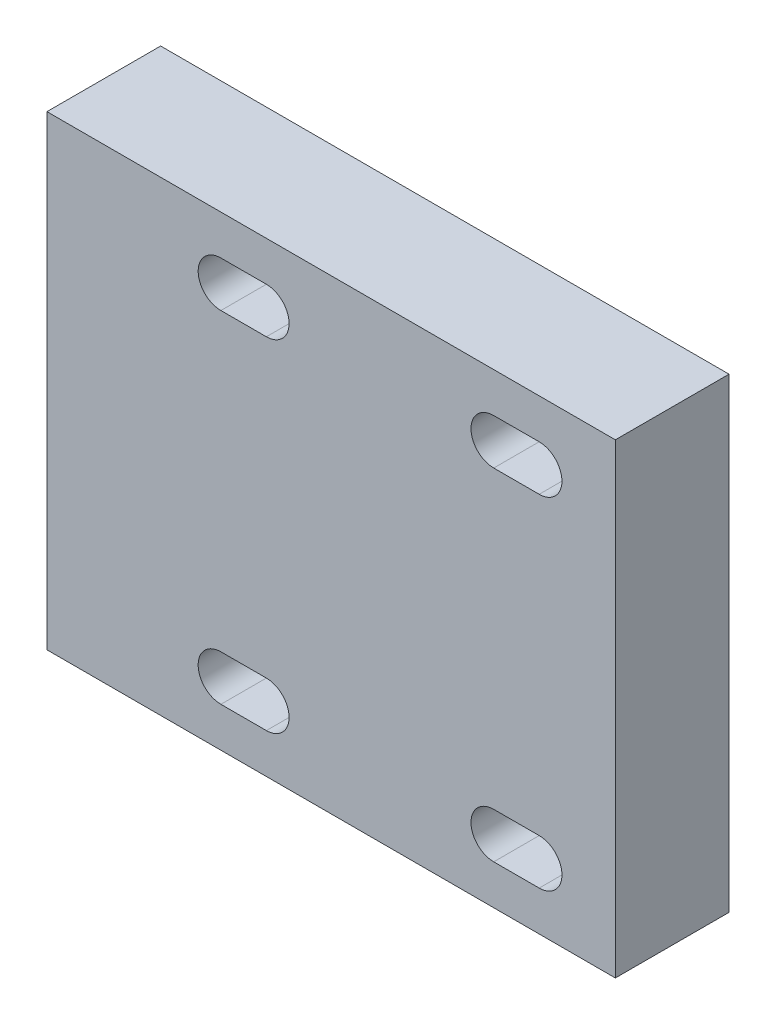
ISO-10303-21;
HEADER;
FILE_DESCRIPTION(('STEP AP214'),'2;1');
FILE_NAME('part.step','',(''),(''),'','','');
FILE_SCHEMA(('AUTOMOTIVE_DESIGN { 1 0 10303 214 1 1 1 1 }'));
ENDSEC;
DATA;
#1=APPLICATION_CONTEXT('core data for automotive mechanical design processes');
#2=APPLICATION_PROTOCOL_DEFINITION('international standard','automotive_design',2000,#1);
#3=PRODUCT_CONTEXT('',#1,'mechanical');
#4=PRODUCT('Part','Part','',(#3));
#5=PRODUCT_RELATED_PRODUCT_CATEGORY('part','',(#4));
#6=PRODUCT_DEFINITION_FORMATION('','',#4);
#7=PRODUCT_DEFINITION_CONTEXT('part definition',#1,'design');
#8=PRODUCT_DEFINITION('design','',#6,#7);
#9=PRODUCT_DEFINITION_SHAPE('','',#8);
#10=(LENGTH_UNIT() NAMED_UNIT(*) SI_UNIT(.MILLI.,.METRE.));
#11=(NAMED_UNIT(*) PLANE_ANGLE_UNIT() SI_UNIT($,.RADIAN.));
#12=(NAMED_UNIT(*) SI_UNIT($,.STERADIAN.) SOLID_ANGLE_UNIT());
#13=UNCERTAINTY_MEASURE_WITH_UNIT(LENGTH_MEASURE(1.E-05),#10,'distance_accuracy_value','');
#14=(GEOMETRIC_REPRESENTATION_CONTEXT(3) GLOBAL_UNCERTAINTY_ASSIGNED_CONTEXT((#13)) GLOBAL_UNIT_ASSIGNED_CONTEXT((#10,
#11,#12)) REPRESENTATION_CONTEXT('',''));
#15=CARTESIAN_POINT('',(0.,0.,0.));
#16=DIRECTION('',(0.,0.,1.));
#17=DIRECTION('',(1.,0.,0.));
#18=AXIS2_PLACEMENT_3D('',#15,#16,#17);
#19=CARTESIAN_POINT('',(-25.,-20.5,10.));
#20=DIRECTION('',(1.,0.,0.));
#21=DIRECTION('',(0.,0.,-1.));
#22=AXIS2_PLACEMENT_3D('',#19,#20,#21);
#23=PLANE('',#22);
#24=DIRECTION('',(0.,-1.,0.));
#25=VECTOR('',#24,1.);
#26=CARTESIAN_POINT('',(-25.,-20.5,0.));
#27=LINE('',#26,#25);
#28=CARTESIAN_POINT('',(-25.,20.5,0.));
#29=VERTEX_POINT('',#28);
#30=CARTESIAN_POINT('',(-25.,-20.5,0.));
#31=VERTEX_POINT('',#30);
#32=EDGE_CURVE('E297',#29,#31,#27,.T.);
#33=ORIENTED_EDGE('',*,*,#32,.T.);
#34=DIRECTION('',(0.,0.,-1.));
#35=VECTOR('',#34,1.);
#36=CARTESIAN_POINT('',(-25.,-20.5,10.));
#37=LINE('',#36,#35);
#38=CARTESIAN_POINT('',(-25.,-20.5,10.));
#39=VERTEX_POINT('',#38);
#40=EDGE_CURVE('E11',#39,#31,#37,.T.);
#41=ORIENTED_EDGE('',*,*,#40,.F.);
#42=DIRECTION('',(0.,-1.,0.));
#43=VECTOR('',#42,1.);
#44=CARTESIAN_POINT('',(-25.,-20.5,10.));
#45=LINE('',#44,#43);
#46=CARTESIAN_POINT('',(-25.,20.5,10.));
#47=VERTEX_POINT('',#46);
#48=EDGE_CURVE('E304',#47,#39,#45,.T.);
#49=ORIENTED_EDGE('',*,*,#48,.F.);
#50=DIRECTION('',(0.,0.,-1.));
#51=VECTOR('',#50,1.);
#52=CARTESIAN_POINT('',(-25.,20.5,10.));
#53=LINE('',#52,#51);
#54=EDGE_CURVE('E314',#47,#29,#53,.T.);
#55=ORIENTED_EDGE('',*,*,#54,.T.);
#56=EDGE_LOOP('',(#33,#41,#49,#55));
#57=FACE_BOUND('',#56,.T.);
#58=ADVANCED_FACE('F32',(#57),#23,.F.);
#59=CARTESIAN_POINT('',(25.,-20.5,10.));
#60=DIRECTION('',(0.,1.,0.));
#61=DIRECTION('',(-1.,0.,0.));
#62=AXIS2_PLACEMENT_3D('',#59,#60,#61);
#63=PLANE('',#62);
#64=DIRECTION('',(1.,0.,0.));
#65=VECTOR('',#64,1.);
#66=CARTESIAN_POINT('',(25.,-20.5,0.));
#67=LINE('',#66,#65);
#68=CARTESIAN_POINT('',(25.,-20.5,0.));
#69=VERTEX_POINT('',#68);
#70=EDGE_CURVE('E317',#31,#69,#67,.T.);
#71=ORIENTED_EDGE('',*,*,#70,.T.);
#72=DIRECTION('',(0.,0.,-1.));
#73=VECTOR('',#72,1.);
#74=CARTESIAN_POINT('',(25.,-20.5,10.));
#75=LINE('',#74,#73);
#76=CARTESIAN_POINT('',(25.,-20.5,10.));
#77=VERTEX_POINT('',#76);
#78=EDGE_CURVE('E39',#77,#69,#75,.T.);
#79=ORIENTED_EDGE('',*,*,#78,.F.);
#80=DIRECTION('',(1.,0.,0.));
#81=VECTOR('',#80,1.);
#82=CARTESIAN_POINT('',(25.,-20.5,10.));
#83=LINE('',#82,#81);
#84=EDGE_CURVE('E307',#39,#77,#83,.T.);
#85=ORIENTED_EDGE('',*,*,#84,.F.);
#86=ORIENTED_EDGE('',*,*,#40,.T.);
#87=EDGE_LOOP('',(#71,#79,#85,#86));
#88=FACE_BOUND('',#87,.T.);
#89=ADVANCED_FACE('F346',(#88),#63,.F.);
#90=CARTESIAN_POINT('',(25.,20.5,10.));
#91=DIRECTION('',(-1.,0.,0.));
#92=DIRECTION('',(0.,-1.,0.));
#93=AXIS2_PLACEMENT_3D('',#90,#91,#92);
#94=PLANE('',#93);
#95=DIRECTION('',(0.,1.,0.));
#96=VECTOR('',#95,1.);
#97=CARTESIAN_POINT('',(25.,20.5,0.));
#98=LINE('',#97,#96);
#99=CARTESIAN_POINT('',(25.,20.5,0.));
#100=VERTEX_POINT('',#99);
#101=EDGE_CURVE('E319',#69,#100,#98,.T.);
#102=ORIENTED_EDGE('',*,*,#101,.T.);
#103=DIRECTION('',(0.,0.,-1.));
#104=VECTOR('',#103,1.);
#105=CARTESIAN_POINT('',(25.,20.5,10.));
#106=LINE('',#105,#104);
#107=CARTESIAN_POINT('',(25.,20.5,10.));
#108=VERTEX_POINT('',#107);
#109=EDGE_CURVE('E324',#108,#100,#106,.T.);
#110=ORIENTED_EDGE('',*,*,#109,.F.);
#111=DIRECTION('',(0.,1.,0.));
#112=VECTOR('',#111,1.);
#113=CARTESIAN_POINT('',(25.,20.5,10.));
#114=LINE('',#113,#112);
#115=EDGE_CURVE('E310',#77,#108,#114,.T.);
#116=ORIENTED_EDGE('',*,*,#115,.F.);
#117=ORIENTED_EDGE('',*,*,#78,.T.);
#118=EDGE_LOOP('',(#102,#110,#116,#117));
#119=FACE_BOUND('',#118,.T.);
#120=ADVANCED_FACE('F331',(#119),#94,.F.);
#121=CARTESIAN_POINT('',(-25.,20.5,10.));
#122=DIRECTION('',(0.,-1.,0.));
#123=DIRECTION('',(0.,0.,-1.));
#124=AXIS2_PLACEMENT_3D('',#121,#122,#123);
#125=PLANE('',#124);
#126=DIRECTION('',(-1.,0.,0.));
#127=VECTOR('',#126,1.);
#128=CARTESIAN_POINT('',(-25.,20.5,0.));
#129=LINE('',#128,#127);
#130=EDGE_CURVE('E308',#100,#29,#129,.T.);
#131=ORIENTED_EDGE('',*,*,#130,.T.);
#132=ORIENTED_EDGE('',*,*,#54,.F.);
#133=DIRECTION('',(-1.,0.,0.));
#134=VECTOR('',#133,1.);
#135=CARTESIAN_POINT('',(-25.,20.5,10.));
#136=LINE('',#135,#134);
#137=EDGE_CURVE('E312',#108,#47,#136,.T.);
#138=ORIENTED_EDGE('',*,*,#137,.F.);
#139=ORIENTED_EDGE('',*,*,#109,.T.);
#140=EDGE_LOOP('',(#131,#132,#138,#139));
#141=FACE_BOUND('',#140,.T.);
#142=ADVANCED_FACE('F340',(#141),#125,.F.);
#143=CARTESIAN_POINT('',(0.,0.,10.));
#144=DIRECTION('',(0.,0.,-1.));
#145=DIRECTION('',(-1.,0.,0.));
#146=AXIS2_PLACEMENT_3D('',#143,#144,#145);
#147=PLANE('',#146);
#148=DIRECTION('',(-1.,0.,0.));
#149=VECTOR('',#148,1.);
#150=CARTESIAN_POINT('',(18.2999999999988,13.0000000000002,10.));
#151=LINE('',#150,#149);
#152=CARTESIAN_POINT('',(18.2999999999988,13.0000000000002,10.));
#153=VERTEX_POINT('',#152);
#154=CARTESIAN_POINT('',(14.2999999999987,13.0000000000002,10.));
#155=VERTEX_POINT('',#154);
#156=EDGE_CURVE('E220',#153,#155,#151,.T.);
#157=ORIENTED_EDGE('',*,*,#156,.T.);
#158=CARTESIAN_POINT('',(14.2999999999987,15.0000000000002,10.));
#159=DIRECTION('',(0.,0.,-1.));
#160=DIRECTION('',(-1.,0.,0.));
#161=AXIS2_PLACEMENT_3D('',#158,#159,#160);
#162=CIRCLE('',#161,2.00000000000001);
#163=CARTESIAN_POINT('',(14.2999999999987,17.0000000000002,10.));
#164=VERTEX_POINT('',#163);
#165=EDGE_CURVE('E212',#155,#164,#162,.T.);
#166=ORIENTED_EDGE('',*,*,#165,.T.);
#167=DIRECTION('',(1.,0.,0.));
#168=VECTOR('',#167,1.);
#169=CARTESIAN_POINT('',(14.2999999999987,17.0000000000002,10.));
#170=LINE('',#169,#168);
#171=CARTESIAN_POINT('',(18.2999999999988,17.0000000000002,10.));
#172=VERTEX_POINT('',#171);
#173=EDGE_CURVE('E215',#164,#172,#170,.T.);
#174=ORIENTED_EDGE('',*,*,#173,.T.);
#175=CARTESIAN_POINT('',(18.2999999999988,15.0000000000002,10.));
#176=DIRECTION('',(0.,0.,-1.));
#177=DIRECTION('',(-1.,0.,0.));
#178=AXIS2_PLACEMENT_3D('',#175,#176,#177);
#179=CIRCLE('',#178,2.00000000000001);
#180=EDGE_CURVE('E46',#172,#153,#179,.T.);
#181=ORIENTED_EDGE('',*,*,#180,.T.);
#182=EDGE_LOOP('',(#157,#166,#174,#181));
#183=FACE_BOUND('',#182,.T.);
#184=DIRECTION('',(1.,0.,0.));
#185=VECTOR('',#184,1.);
#186=CARTESIAN_POINT('',(-5.70000000000125,-13.0000000000002,10.));
#187=LINE('',#186,#185);
#188=CARTESIAN_POINT('',(-9.70000000000126,-13.0000000000002,10.));
#189=VERTEX_POINT('',#188);
#190=CARTESIAN_POINT('',(-5.70000000000125,-13.0000000000002,10.));
#191=VERTEX_POINT('',#190);
#192=EDGE_CURVE('E252',#189,#191,#187,.T.);
#193=ORIENTED_EDGE('',*,*,#192,.T.);
#194=CARTESIAN_POINT('',(-5.70000000000125,-15.0000000000002,10.));
#195=DIRECTION('',(0.,0.,-1.));
#196=DIRECTION('',(1.,0.,0.));
#197=AXIS2_PLACEMENT_3D('',#194,#195,#196);
#198=CIRCLE('',#197,2.);
#199=CARTESIAN_POINT('',(-5.70000000000125,-17.0000000000002,10.));
#200=VERTEX_POINT('',#199);
#201=EDGE_CURVE('E244',#191,#200,#198,.T.);
#202=ORIENTED_EDGE('',*,*,#201,.T.);
#203=DIRECTION('',(-1.,0.,0.));
#204=VECTOR('',#203,1.);
#205=CARTESIAN_POINT('',(-9.70000000000126,-17.0000000000002,10.));
#206=LINE('',#205,#204);
#207=CARTESIAN_POINT('',(-9.70000000000126,-17.0000000000002,10.));
#208=VERTEX_POINT('',#207);
#209=EDGE_CURVE('E247',#200,#208,#206,.T.);
#210=ORIENTED_EDGE('',*,*,#209,.T.);
#211=CARTESIAN_POINT('',(-9.70000000000126,-15.0000000000002,10.));
#212=DIRECTION('',(0.,0.,-1.));
#213=DIRECTION('',(1.,0.,0.));
#214=AXIS2_PLACEMENT_3D('',#211,#212,#213);
#215=CIRCLE('',#214,2.00000000000001);
#216=EDGE_CURVE('E54',#208,#189,#215,.T.);
#217=ORIENTED_EDGE('',*,*,#216,.T.);
#218=EDGE_LOOP('',(#193,#202,#210,#217));
#219=FACE_BOUND('',#218,.T.);
#220=DIRECTION('',(1.,0.,0.));
#221=VECTOR('',#220,1.);
#222=CARTESIAN_POINT('',(18.2999999999988,-13.0000000000002,10.));
#223=LINE('',#222,#221);
#224=CARTESIAN_POINT('',(14.2999999999987,-13.0000000000002,10.));
#225=VERTEX_POINT('',#224);
#226=CARTESIAN_POINT('',(18.2999999999988,-13.0000000000002,10.));
#227=VERTEX_POINT('',#226);
#228=EDGE_CURVE('E180',#225,#227,#223,.T.);
#229=ORIENTED_EDGE('',*,*,#228,.T.);
#230=CARTESIAN_POINT('',(18.2999999999988,-15.0000000000002,10.));
#231=DIRECTION('',(0.,0.,-1.));
#232=DIRECTION('',(1.,0.,0.));
#233=AXIS2_PLACEMENT_3D('',#230,#231,#232);
#234=CIRCLE('',#233,2.00000000000001);
#235=CARTESIAN_POINT('',(18.2999999999988,-17.0000000000002,10.));
#236=VERTEX_POINT('',#235);
#237=EDGE_CURVE('E172',#227,#236,#234,.T.);
#238=ORIENTED_EDGE('',*,*,#237,.T.);
#239=DIRECTION('',(-1.,0.,0.));
#240=VECTOR('',#239,1.);
#241=CARTESIAN_POINT('',(14.2999999999987,-17.0000000000002,10.));
#242=LINE('',#241,#240);
#243=CARTESIAN_POINT('',(14.2999999999987,-17.0000000000002,10.));
#244=VERTEX_POINT('',#243);
#245=EDGE_CURVE('E184',#236,#244,#242,.T.);
#246=ORIENTED_EDGE('',*,*,#245,.T.);
#247=CARTESIAN_POINT('',(14.2999999999987,-15.0000000000002,10.));
#248=DIRECTION('',(0.,0.,-1.));
#249=DIRECTION('',(1.,0.,0.));
#250=AXIS2_PLACEMENT_3D('',#247,#248,#249);
#251=CIRCLE('',#250,2.00000000000001);
#252=EDGE_CURVE('E188',#244,#225,#251,.T.);
#253=ORIENTED_EDGE('',*,*,#252,.T.);
#254=EDGE_LOOP('',(#229,#238,#246,#253));
#255=FACE_BOUND('',#254,.T.);
#256=DIRECTION('',(1.,0.,0.));
#257=VECTOR('',#256,1.);
#258=CARTESIAN_POINT('',(-9.70000000000126,17.0000000000002,10.));
#259=LINE('',#258,#257);
#260=CARTESIAN_POINT('',(-9.70000000000126,17.0000000000002,10.));
#261=VERTEX_POINT('',#260);
#262=CARTESIAN_POINT('',(-5.70000000000125,17.0000000000002,10.));
#263=VERTEX_POINT('',#262);
#264=EDGE_CURVE('E282',#261,#263,#259,.T.);
#265=ORIENTED_EDGE('',*,*,#264,.T.);
#266=CARTESIAN_POINT('',(-5.70000000000125,15.0000000000002,10.));
#267=DIRECTION('',(0.,0.,-1.));
#268=DIRECTION('',(-1.,0.,0.));
#269=AXIS2_PLACEMENT_3D('',#266,#267,#268);
#270=CIRCLE('',#269,2.);
#271=CARTESIAN_POINT('',(-5.70000000000125,13.0000000000002,10.));
#272=VERTEX_POINT('',#271);
#273=EDGE_CURVE('E272',#263,#272,#270,.T.);
#274=ORIENTED_EDGE('',*,*,#273,.T.);
#275=DIRECTION('',(-1.,0.,0.));
#276=VECTOR('',#275,1.);
#277=CARTESIAN_POINT('',(-5.70000000000125,13.0000000000002,10.));
#278=LINE('',#277,#276);
#279=CARTESIAN_POINT('',(-9.70000000000126,13.0000000000002,10.));
#280=VERTEX_POINT('',#279);
#281=EDGE_CURVE('E275',#272,#280,#278,.T.);
#282=ORIENTED_EDGE('',*,*,#281,.T.);
#283=CARTESIAN_POINT('',(-9.70000000000126,15.0000000000002,10.));
#284=DIRECTION('',(0.,0.,-1.));
#285=DIRECTION('',(-1.,0.,0.));
#286=AXIS2_PLACEMENT_3D('',#283,#284,#285);
#287=CIRCLE('',#286,2.00000000000001);
#288=EDGE_CURVE('E279',#280,#261,#287,.T.);
#289=ORIENTED_EDGE('',*,*,#288,.T.);
#290=EDGE_LOOP('',(#265,#274,#282,#289));
#291=FACE_BOUND('',#290,.T.);
#292=ORIENTED_EDGE('',*,*,#48,.T.);
#293=ORIENTED_EDGE('',*,*,#84,.T.);
#294=ORIENTED_EDGE('',*,*,#115,.T.);
#295=ORIENTED_EDGE('',*,*,#137,.T.);
#296=EDGE_LOOP('',(#292,#293,#294,#295));
#297=FACE_BOUND('',#296,.T.);
#298=ADVANCED_FACE('F190',(#183,#219,#255,#291,#297),#147,.F.);
#299=CARTESIAN_POINT('',(0.,0.,0.));
#300=DIRECTION('',(0.,0.,-1.));
#301=DIRECTION('',(-1.,0.,0.));
#302=AXIS2_PLACEMENT_3D('',#299,#300,#301);
#303=PLANE('',#302);
#304=CARTESIAN_POINT('',(14.2999999999987,15.0000000000002,0.));
#305=DIRECTION('',(0.,0.,-1.));
#306=DIRECTION('',(-1.,0.,0.));
#307=AXIS2_PLACEMENT_3D('',#304,#305,#306);
#308=CIRCLE('',#307,2.00000000000001);
#309=CARTESIAN_POINT('',(14.2999999999987,13.0000000000002,0.));
#310=VERTEX_POINT('',#309);
#311=CARTESIAN_POINT('',(14.2999999999987,17.0000000000002,0.));
#312=VERTEX_POINT('',#311);
#313=EDGE_CURVE('E224',#310,#312,#308,.T.);
#314=ORIENTED_EDGE('',*,*,#313,.F.);
#315=DIRECTION('',(-1.,0.,0.));
#316=VECTOR('',#315,1.);
#317=CARTESIAN_POINT('',(18.2999999999988,13.0000000000002,0.));
#318=LINE('',#317,#316);
#319=CARTESIAN_POINT('',(18.2999999999988,13.0000000000002,0.));
#320=VERTEX_POINT('',#319);
#321=EDGE_CURVE('E216',#320,#310,#318,.T.);
#322=ORIENTED_EDGE('',*,*,#321,.F.);
#323=CARTESIAN_POINT('',(18.2999999999988,15.0000000000002,0.));
#324=DIRECTION('',(0.,0.,-1.));
#325=DIRECTION('',(-1.,0.,0.));
#326=AXIS2_PLACEMENT_3D('',#323,#324,#325);
#327=CIRCLE('',#326,2.00000000000001);
#328=CARTESIAN_POINT('',(18.2999999999988,17.0000000000002,0.));
#329=VERTEX_POINT('',#328);
#330=EDGE_CURVE('E230',#329,#320,#327,.T.);
#331=ORIENTED_EDGE('',*,*,#330,.F.);
#332=DIRECTION('',(1.,0.,0.));
#333=VECTOR('',#332,1.);
#334=CARTESIAN_POINT('',(14.2999999999987,17.0000000000002,0.));
#335=LINE('',#334,#333);
#336=EDGE_CURVE('E226',#312,#329,#335,.T.);
#337=ORIENTED_EDGE('',*,*,#336,.F.);
#338=EDGE_LOOP('',(#314,#322,#331,#337));
#339=FACE_BOUND('',#338,.T.);
#340=CARTESIAN_POINT('',(-5.70000000000125,-15.0000000000002,0.));
#341=DIRECTION('',(0.,0.,-1.));
#342=DIRECTION('',(1.,0.,0.));
#343=AXIS2_PLACEMENT_3D('',#340,#341,#342);
#344=CIRCLE('',#343,2.);
#345=CARTESIAN_POINT('',(-5.70000000000125,-13.0000000000002,0.));
#346=VERTEX_POINT('',#345);
#347=CARTESIAN_POINT('',(-5.70000000000125,-17.0000000000002,0.));
#348=VERTEX_POINT('',#347);
#349=EDGE_CURVE('E208',#346,#348,#344,.T.);
#350=ORIENTED_EDGE('',*,*,#349,.F.);
#351=DIRECTION('',(1.,0.,0.));
#352=VECTOR('',#351,1.);
#353=CARTESIAN_POINT('',(-5.70000000000125,-13.0000000000002,0.));
#354=LINE('',#353,#352);
#355=CARTESIAN_POINT('',(-9.70000000000126,-13.0000000000002,0.));
#356=VERTEX_POINT('',#355);
#357=EDGE_CURVE('E248',#356,#346,#354,.T.);
#358=ORIENTED_EDGE('',*,*,#357,.F.);
#359=CARTESIAN_POINT('',(-9.70000000000126,-15.0000000000002,0.));
#360=DIRECTION('',(0.,0.,-1.));
#361=DIRECTION('',(1.,0.,0.));
#362=AXIS2_PLACEMENT_3D('',#359,#360,#361);
#363=CIRCLE('',#362,2.00000000000001);
#364=CARTESIAN_POINT('',(-9.70000000000126,-17.0000000000002,0.));
#365=VERTEX_POINT('',#364);
#366=EDGE_CURVE('E260',#365,#356,#363,.T.);
#367=ORIENTED_EDGE('',*,*,#366,.F.);
#368=DIRECTION('',(-1.,0.,0.));
#369=VECTOR('',#368,1.);
#370=CARTESIAN_POINT('',(-9.70000000000126,-17.0000000000002,0.));
#371=LINE('',#370,#369);
#372=EDGE_CURVE('E257',#348,#365,#371,.T.);
#373=ORIENTED_EDGE('',*,*,#372,.F.);
#374=EDGE_LOOP('',(#350,#358,#367,#373));
#375=FACE_BOUND('',#374,.T.);
#376=CARTESIAN_POINT('',(18.2999999999988,-15.0000000000002,0.));
#377=DIRECTION('',(0.,0.,-1.));
#378=DIRECTION('',(1.,0.,0.));
#379=AXIS2_PLACEMENT_3D('',#376,#377,#378);
#380=CIRCLE('',#379,2.00000000000001);
#381=CARTESIAN_POINT('',(18.2999999999988,-13.0000000000002,0.));
#382=VERTEX_POINT('',#381);
#383=CARTESIAN_POINT('',(18.2999999999988,-17.0000000000002,0.));
#384=VERTEX_POINT('',#383);
#385=EDGE_CURVE('E175',#382,#384,#380,.T.);
#386=ORIENTED_EDGE('',*,*,#385,.F.);
#387=DIRECTION('',(1.,0.,0.));
#388=VECTOR('',#387,1.);
#389=CARTESIAN_POINT('',(18.2999999999988,-13.0000000000002,0.));
#390=LINE('',#389,#388);
#391=CARTESIAN_POINT('',(14.2999999999987,-13.0000000000002,0.));
#392=VERTEX_POINT('',#391);
#393=EDGE_CURVE('E193',#392,#382,#390,.T.);
#394=ORIENTED_EDGE('',*,*,#393,.F.);
#395=CARTESIAN_POINT('',(14.2999999999987,-15.0000000000002,0.));
#396=DIRECTION('',(0.,0.,-1.));
#397=DIRECTION('',(1.,0.,0.));
#398=AXIS2_PLACEMENT_3D('',#395,#396,#397);
#399=CIRCLE('',#398,2.00000000000001);
#400=CARTESIAN_POINT('',(14.2999999999987,-17.0000000000002,0.));
#401=VERTEX_POINT('',#400);
#402=EDGE_CURVE('E196',#401,#392,#399,.T.);
#403=ORIENTED_EDGE('',*,*,#402,.F.);
#404=DIRECTION('',(-1.,0.,0.));
#405=VECTOR('',#404,1.);
#406=CARTESIAN_POINT('',(14.2999999999987,-17.0000000000002,0.));
#407=LINE('',#406,#405);
#408=EDGE_CURVE('E202',#384,#401,#407,.T.);
#409=ORIENTED_EDGE('',*,*,#408,.F.);
#410=EDGE_LOOP('',(#386,#394,#403,#409));
#411=FACE_BOUND('',#410,.T.);
#412=CARTESIAN_POINT('',(-5.70000000000125,15.0000000000002,0.));
#413=DIRECTION('',(0.,0.,-1.));
#414=DIRECTION('',(-1.,0.,0.));
#415=AXIS2_PLACEMENT_3D('',#412,#413,#414);
#416=CIRCLE('',#415,2.);
#417=CARTESIAN_POINT('',(-5.70000000000125,17.0000000000002,0.));
#418=VERTEX_POINT('',#417);
#419=CARTESIAN_POINT('',(-5.70000000000125,13.0000000000002,0.));
#420=VERTEX_POINT('',#419);
#421=EDGE_CURVE('E237',#418,#420,#416,.T.);
#422=ORIENTED_EDGE('',*,*,#421,.F.);
#423=DIRECTION('',(1.,0.,0.));
#424=VECTOR('',#423,1.);
#425=CARTESIAN_POINT('',(-9.70000000000126,17.0000000000002,0.));
#426=LINE('',#425,#424);
#427=CARTESIAN_POINT('',(-9.70000000000126,17.0000000000002,0.));
#428=VERTEX_POINT('',#427);
#429=EDGE_CURVE('E276',#428,#418,#426,.T.);
#430=ORIENTED_EDGE('',*,*,#429,.F.);
#431=CARTESIAN_POINT('',(-9.70000000000126,15.0000000000002,0.));
#432=DIRECTION('',(0.,0.,-1.));
#433=DIRECTION('',(-1.,0.,0.));
#434=AXIS2_PLACEMENT_3D('',#431,#432,#433);
#435=CIRCLE('',#434,2.00000000000001);
#436=CARTESIAN_POINT('',(-9.70000000000126,13.0000000000002,0.));
#437=VERTEX_POINT('',#436);
#438=EDGE_CURVE('E290',#437,#428,#435,.T.);
#439=ORIENTED_EDGE('',*,*,#438,.F.);
#440=DIRECTION('',(-1.,0.,0.));
#441=VECTOR('',#440,1.);
#442=CARTESIAN_POINT('',(-5.70000000000125,13.0000000000002,0.));
#443=LINE('',#442,#441);
#444=EDGE_CURVE('E287',#420,#437,#443,.T.);
#445=ORIENTED_EDGE('',*,*,#444,.F.);
#446=EDGE_LOOP('',(#422,#430,#439,#445));
#447=FACE_BOUND('',#446,.T.);
#448=ORIENTED_EDGE('',*,*,#32,.F.);
#449=ORIENTED_EDGE('',*,*,#130,.F.);
#450=ORIENTED_EDGE('',*,*,#101,.F.);
#451=ORIENTED_EDGE('',*,*,#70,.F.);
#452=EDGE_LOOP('',(#448,#449,#450,#451));
#453=FACE_BOUND('',#452,.T.);
#454=ADVANCED_FACE('F337',(#339,#375,#411,#447,#453),#303,.T.);
#455=CARTESIAN_POINT('',(-5.70000000000125,15.0000000000002,10.));
#456=DIRECTION('',(0.,0.,-1.));
#457=DIRECTION('',(-1.,0.,0.));
#458=AXIS2_PLACEMENT_3D('',#455,#456,#457);
#459=CYLINDRICAL_SURFACE('',#458,2.);
#460=ORIENTED_EDGE('',*,*,#421,.T.);
#461=DIRECTION('',(0.,0.,-1.));
#462=VECTOR('',#461,1.);
#463=CARTESIAN_POINT('',(-5.70000000000125,13.0000000000002,10.));
#464=LINE('',#463,#462);
#465=EDGE_CURVE('E285',#272,#420,#464,.T.);
#466=ORIENTED_EDGE('',*,*,#465,.F.);
#467=ORIENTED_EDGE('',*,*,#273,.F.);
#468=DIRECTION('',(0.,0.,-1.));
#469=VECTOR('',#468,1.);
#470=CARTESIAN_POINT('',(-5.70000000000125,17.0000000000002,10.));
#471=LINE('',#470,#469);
#472=EDGE_CURVE('E295',#263,#418,#471,.T.);
#473=ORIENTED_EDGE('',*,*,#472,.T.);
#474=EDGE_LOOP('',(#460,#466,#467,#473));
#475=FACE_BOUND('',#474,.T.);
#476=ADVANCED_FACE('F358',(#475),#459,.F.);
#477=CARTESIAN_POINT('',(-9.70000000000126,17.0000000000002,10.));
#478=DIRECTION('',(0.,1.,0.));
#479=DIRECTION('',(0.,0.,1.));
#480=AXIS2_PLACEMENT_3D('',#477,#478,#479);
#481=PLANE('',#480);
#482=ORIENTED_EDGE('',*,*,#429,.T.);
#483=ORIENTED_EDGE('',*,*,#472,.F.);
#484=ORIENTED_EDGE('',*,*,#264,.F.);
#485=DIRECTION('',(0.,0.,-1.));
#486=VECTOR('',#485,1.);
#487=CARTESIAN_POINT('',(-9.70000000000126,17.0000000000002,10.));
#488=LINE('',#487,#486);
#489=EDGE_CURVE('E298',#261,#428,#488,.T.);
#490=ORIENTED_EDGE('',*,*,#489,.T.);
#491=EDGE_LOOP('',(#482,#483,#484,#490));
#492=FACE_BOUND('',#491,.T.);
#493=ADVANCED_FACE('F365',(#492),#481,.F.);
#494=CARTESIAN_POINT('',(-9.70000000000126,15.0000000000002,10.));
#495=DIRECTION('',(0.,0.,-1.));
#496=DIRECTION('',(-1.,0.,0.));
#497=AXIS2_PLACEMENT_3D('',#494,#495,#496);
#498=CYLINDRICAL_SURFACE('',#497,2.00000000000001);
#499=ORIENTED_EDGE('',*,*,#438,.T.);
#500=ORIENTED_EDGE('',*,*,#489,.F.);
#501=ORIENTED_EDGE('',*,*,#288,.F.);
#502=DIRECTION('',(0.,0.,-1.));
#503=VECTOR('',#502,1.);
#504=CARTESIAN_POINT('',(-9.70000000000126,13.0000000000002,10.));
#505=LINE('',#504,#503);
#506=EDGE_CURVE('E300',#280,#437,#505,.T.);
#507=ORIENTED_EDGE('',*,*,#506,.T.);
#508=EDGE_LOOP('',(#499,#500,#501,#507));
#509=FACE_BOUND('',#508,.T.);
#510=ADVANCED_FACE('F370',(#509),#498,.F.);
#511=CARTESIAN_POINT('',(-5.70000000000125,13.0000000000002,10.));
#512=DIRECTION('',(0.,-1.,0.));
#513=DIRECTION('',(1.,0.,0.));
#514=AXIS2_PLACEMENT_3D('',#511,#512,#513);
#515=PLANE('',#514);
#516=ORIENTED_EDGE('',*,*,#444,.T.);
#517=ORIENTED_EDGE('',*,*,#506,.F.);
#518=ORIENTED_EDGE('',*,*,#281,.F.);
#519=ORIENTED_EDGE('',*,*,#465,.T.);
#520=EDGE_LOOP('',(#516,#517,#518,#519));
#521=FACE_BOUND('',#520,.T.);
#522=ADVANCED_FACE('F367',(#521),#515,.F.);
#523=CARTESIAN_POINT('',(18.2999999999988,-15.0000000000002,10.));
#524=DIRECTION('',(0.,0.,-1.));
#525=DIRECTION('',(-1.,0.,0.));
#526=AXIS2_PLACEMENT_3D('',#523,#524,#525);
#527=CYLINDRICAL_SURFACE('',#526,2.00000000000001);
#528=ORIENTED_EDGE('',*,*,#385,.T.);
#529=DIRECTION('',(0.,0.,-1.));
#530=VECTOR('',#529,1.);
#531=CARTESIAN_POINT('',(18.2999999999988,-17.0000000000002,10.));
#532=LINE('',#531,#530);
#533=EDGE_CURVE('E168',#236,#384,#532,.T.);
#534=ORIENTED_EDGE('',*,*,#533,.F.);
#535=ORIENTED_EDGE('',*,*,#237,.F.);
#536=DIRECTION('',(0.,0.,-1.));
#537=VECTOR('',#536,1.);
#538=CARTESIAN_POINT('',(18.2999999999988,-13.0000000000002,10.));
#539=LINE('',#538,#537);
#540=EDGE_CURVE('E206',#227,#382,#539,.T.);
#541=ORIENTED_EDGE('',*,*,#540,.T.);
#542=EDGE_LOOP('',(#528,#534,#535,#541));
#543=FACE_BOUND('',#542,.T.);
#544=ADVANCED_FACE('F170',(#543),#527,.F.);
#545=CARTESIAN_POINT('',(18.2999999999988,-13.0000000000002,10.));
#546=DIRECTION('',(0.,1.,0.));
#547=DIRECTION('',(0.,0.,1.));
#548=AXIS2_PLACEMENT_3D('',#545,#546,#547);
#549=PLANE('',#548);
#550=ORIENTED_EDGE('',*,*,#393,.T.);
#551=ORIENTED_EDGE('',*,*,#540,.F.);
#552=ORIENTED_EDGE('',*,*,#228,.F.);
#553=DIRECTION('',(0.,0.,-1.));
#554=VECTOR('',#553,1.);
#555=CARTESIAN_POINT('',(14.2999999999987,-13.0000000000002,10.));
#556=LINE('',#555,#554);
#557=EDGE_CURVE('E209',#225,#392,#556,.T.);
#558=ORIENTED_EDGE('',*,*,#557,.T.);
#559=EDGE_LOOP('',(#550,#551,#552,#558));
#560=FACE_BOUND('',#559,.T.);
#561=ADVANCED_FACE('F410',(#560),#549,.F.);
#562=CARTESIAN_POINT('',(14.2999999999987,-15.0000000000002,10.));
#563=DIRECTION('',(0.,0.,-1.));
#564=DIRECTION('',(-1.,0.,0.));
#565=AXIS2_PLACEMENT_3D('',#562,#563,#564);
#566=CYLINDRICAL_SURFACE('',#565,2.00000000000001);
#567=ORIENTED_EDGE('',*,*,#402,.T.);
#568=ORIENTED_EDGE('',*,*,#557,.F.);
#569=ORIENTED_EDGE('',*,*,#252,.F.);
#570=DIRECTION('',(0.,0.,-1.));
#571=VECTOR('',#570,1.);
#572=CARTESIAN_POINT('',(14.2999999999987,-17.0000000000002,10.));
#573=LINE('',#572,#571);
#574=EDGE_CURVE('E179',#244,#401,#573,.T.);
#575=ORIENTED_EDGE('',*,*,#574,.T.);
#576=EDGE_LOOP('',(#567,#568,#569,#575));
#577=FACE_BOUND('',#576,.T.);
#578=ADVANCED_FACE('F413',(#577),#566,.F.);
#579=CARTESIAN_POINT('',(14.2999999999987,-17.0000000000002,10.));
#580=DIRECTION('',(0.,-1.,0.));
#581=DIRECTION('',(0.,0.,-1.));
#582=AXIS2_PLACEMENT_3D('',#579,#580,#581);
#583=PLANE('',#582);
#584=ORIENTED_EDGE('',*,*,#408,.T.);
#585=ORIENTED_EDGE('',*,*,#574,.F.);
#586=ORIENTED_EDGE('',*,*,#245,.F.);
#587=ORIENTED_EDGE('',*,*,#533,.T.);
#588=EDGE_LOOP('',(#584,#585,#586,#587));
#589=FACE_BOUND('',#588,.T.);
#590=ADVANCED_FACE('F185',(#589),#583,.F.);
#591=CARTESIAN_POINT('',(-5.70000000000125,-15.0000000000002,10.));
#592=DIRECTION('',(0.,0.,-1.));
#593=DIRECTION('',(-1.,0.,0.));
#594=AXIS2_PLACEMENT_3D('',#591,#592,#593);
#595=CYLINDRICAL_SURFACE('',#594,2.);
#596=ORIENTED_EDGE('',*,*,#349,.T.);
#597=DIRECTION('',(0.,0.,-1.));
#598=VECTOR('',#597,1.);
#599=CARTESIAN_POINT('',(-5.70000000000125,-17.0000000000002,10.));
#600=LINE('',#599,#598);
#601=EDGE_CURVE('E255',#200,#348,#600,.T.);
#602=ORIENTED_EDGE('',*,*,#601,.F.);
#603=ORIENTED_EDGE('',*,*,#201,.F.);
#604=DIRECTION('',(0.,0.,-1.));
#605=VECTOR('',#604,1.);
#606=CARTESIAN_POINT('',(-5.70000000000125,-13.0000000000002,10.));
#607=LINE('',#606,#605);
#608=EDGE_CURVE('E227',#191,#346,#607,.T.);
#609=ORIENTED_EDGE('',*,*,#608,.T.);
#610=EDGE_LOOP('',(#596,#602,#603,#609));
#611=FACE_BOUND('',#610,.T.);
#612=ADVANCED_FACE('F378',(#611),#595,.F.);
#613=CARTESIAN_POINT('',(-5.70000000000125,-13.0000000000002,10.));
#614=DIRECTION('',(0.,1.,0.));
#615=DIRECTION('',(-1.,0.,0.));
#616=AXIS2_PLACEMENT_3D('',#613,#614,#615);
#617=PLANE('',#616);
#618=ORIENTED_EDGE('',*,*,#357,.T.);
#619=ORIENTED_EDGE('',*,*,#608,.F.);
#620=ORIENTED_EDGE('',*,*,#192,.F.);
#621=DIRECTION('',(0.,0.,-1.));
#622=VECTOR('',#621,1.);
#623=CARTESIAN_POINT('',(-9.70000000000126,-13.0000000000002,10.));
#624=LINE('',#623,#622);
#625=EDGE_CURVE('E266',#189,#356,#624,.T.);
#626=ORIENTED_EDGE('',*,*,#625,.T.);
#627=EDGE_LOOP('',(#618,#619,#620,#626));
#628=FACE_BOUND('',#627,.T.);
#629=ADVANCED_FACE('F381',(#628),#617,.F.);
#630=CARTESIAN_POINT('',(-9.70000000000126,-15.0000000000002,10.));
#631=DIRECTION('',(0.,0.,-1.));
#632=DIRECTION('',(-1.,0.,0.));
#633=AXIS2_PLACEMENT_3D('',#630,#631,#632);
#634=CYLINDRICAL_SURFACE('',#633,2.00000000000001);
#635=ORIENTED_EDGE('',*,*,#366,.T.);
#636=ORIENTED_EDGE('',*,*,#625,.F.);
#637=ORIENTED_EDGE('',*,*,#216,.F.);
#638=DIRECTION('',(0.,0.,-1.));
#639=VECTOR('',#638,1.);
#640=CARTESIAN_POINT('',(-9.70000000000126,-17.0000000000002,10.));
#641=LINE('',#640,#639);
#642=EDGE_CURVE('E268',#208,#365,#641,.T.);
#643=ORIENTED_EDGE('',*,*,#642,.T.);
#644=EDGE_LOOP('',(#635,#636,#637,#643));
#645=FACE_BOUND('',#644,.T.);
#646=ADVANCED_FACE('F387',(#645),#634,.F.);
#647=CARTESIAN_POINT('',(-9.70000000000126,-17.0000000000002,10.));
#648=DIRECTION('',(0.,-1.,0.));
#649=DIRECTION('',(0.,0.,-1.));
#650=AXIS2_PLACEMENT_3D('',#647,#648,#649);
#651=PLANE('',#650);
#652=ORIENTED_EDGE('',*,*,#372,.T.);
#653=ORIENTED_EDGE('',*,*,#642,.F.);
#654=ORIENTED_EDGE('',*,*,#209,.F.);
#655=ORIENTED_EDGE('',*,*,#601,.T.);
#656=EDGE_LOOP('',(#652,#653,#654,#655));
#657=FACE_BOUND('',#656,.T.);
#658=ADVANCED_FACE('F383',(#657),#651,.F.);
#659=CARTESIAN_POINT('',(14.2999999999987,15.0000000000002,10.));
#660=DIRECTION('',(0.,0.,-1.));
#661=DIRECTION('',(-1.,0.,0.));
#662=AXIS2_PLACEMENT_3D('',#659,#660,#661);
#663=CYLINDRICAL_SURFACE('',#662,2.00000000000001);
#664=ORIENTED_EDGE('',*,*,#313,.T.);
#665=DIRECTION('',(0.,0.,-1.));
#666=VECTOR('',#665,1.);
#667=CARTESIAN_POINT('',(14.2999999999987,17.0000000000002,10.));
#668=LINE('',#667,#666);
#669=EDGE_CURVE('E223',#164,#312,#668,.T.);
#670=ORIENTED_EDGE('',*,*,#669,.F.);
#671=ORIENTED_EDGE('',*,*,#165,.F.);
#672=DIRECTION('',(0.,0.,-1.));
#673=VECTOR('',#672,1.);
#674=CARTESIAN_POINT('',(14.2999999999987,13.0000000000002,10.));
#675=LINE('',#674,#673);
#676=EDGE_CURVE('E235',#155,#310,#675,.T.);
#677=ORIENTED_EDGE('',*,*,#676,.T.);
#678=EDGE_LOOP('',(#664,#670,#671,#677));
#679=FACE_BOUND('',#678,.T.);
#680=ADVANCED_FACE('F386',(#679),#663,.F.);
#681=CARTESIAN_POINT('',(18.2999999999988,13.0000000000002,10.));
#682=DIRECTION('',(0.,-1.,0.));
#683=DIRECTION('',(0.,0.,-1.));
#684=AXIS2_PLACEMENT_3D('',#681,#682,#683);
#685=PLANE('',#684);
#686=ORIENTED_EDGE('',*,*,#321,.T.);
#687=ORIENTED_EDGE('',*,*,#676,.F.);
#688=ORIENTED_EDGE('',*,*,#156,.F.);
#689=DIRECTION('',(0.,0.,-1.));
#690=VECTOR('',#689,1.);
#691=CARTESIAN_POINT('',(18.2999999999988,13.0000000000002,10.));
#692=LINE('',#691,#690);
#693=EDGE_CURVE('E238',#153,#320,#692,.T.);
#694=ORIENTED_EDGE('',*,*,#693,.T.);
#695=EDGE_LOOP('',(#686,#687,#688,#694));
#696=FACE_BOUND('',#695,.T.);
#697=ADVANCED_FACE('F396',(#696),#685,.F.);
#698=CARTESIAN_POINT('',(18.2999999999988,15.0000000000002,10.));
#699=DIRECTION('',(0.,0.,-1.));
#700=DIRECTION('',(-1.,0.,0.));
#701=AXIS2_PLACEMENT_3D('',#698,#699,#700);
#702=CYLINDRICAL_SURFACE('',#701,2.00000000000001);
#703=ORIENTED_EDGE('',*,*,#330,.T.);
#704=ORIENTED_EDGE('',*,*,#693,.F.);
#705=ORIENTED_EDGE('',*,*,#180,.F.);
#706=DIRECTION('',(0.,0.,-1.));
#707=VECTOR('',#706,1.);
#708=CARTESIAN_POINT('',(18.2999999999988,17.0000000000002,10.));
#709=LINE('',#708,#707);
#710=EDGE_CURVE('E240',#172,#329,#709,.T.);
#711=ORIENTED_EDGE('',*,*,#710,.T.);
#712=EDGE_LOOP('',(#703,#704,#705,#711));
#713=FACE_BOUND('',#712,.T.);
#714=ADVANCED_FACE('F401',(#713),#702,.F.);
#715=CARTESIAN_POINT('',(14.2999999999987,17.0000000000002,10.));
#716=DIRECTION('',(0.,1.,0.));
#717=DIRECTION('',(0.,0.,1.));
#718=AXIS2_PLACEMENT_3D('',#715,#716,#717);
#719=PLANE('',#718);
#720=ORIENTED_EDGE('',*,*,#336,.T.);
#721=ORIENTED_EDGE('',*,*,#710,.F.);
#722=ORIENTED_EDGE('',*,*,#173,.F.);
#723=ORIENTED_EDGE('',*,*,#669,.T.);
#724=EDGE_LOOP('',(#720,#721,#722,#723));
#725=FACE_BOUND('',#724,.T.);
#726=ADVANCED_FACE('F398',(#725),#719,.F.);
#727=CLOSED_SHELL('',(#58,#89,#120,#142,#298,#454,#476,#493,#510,#522,#544,#561,#578,#590,#612,
#629,#646,#658,#680,#697,#714,#726));
#728=MANIFOLD_SOLID_BREP('B2',#727);
#729=ADVANCED_BREP_SHAPE_REPRESENTATION('',(#18,#728),#14);
#730=SHAPE_DEFINITION_REPRESENTATION(#9,#729);
ENDSEC;
END-ISO-10303-21;
